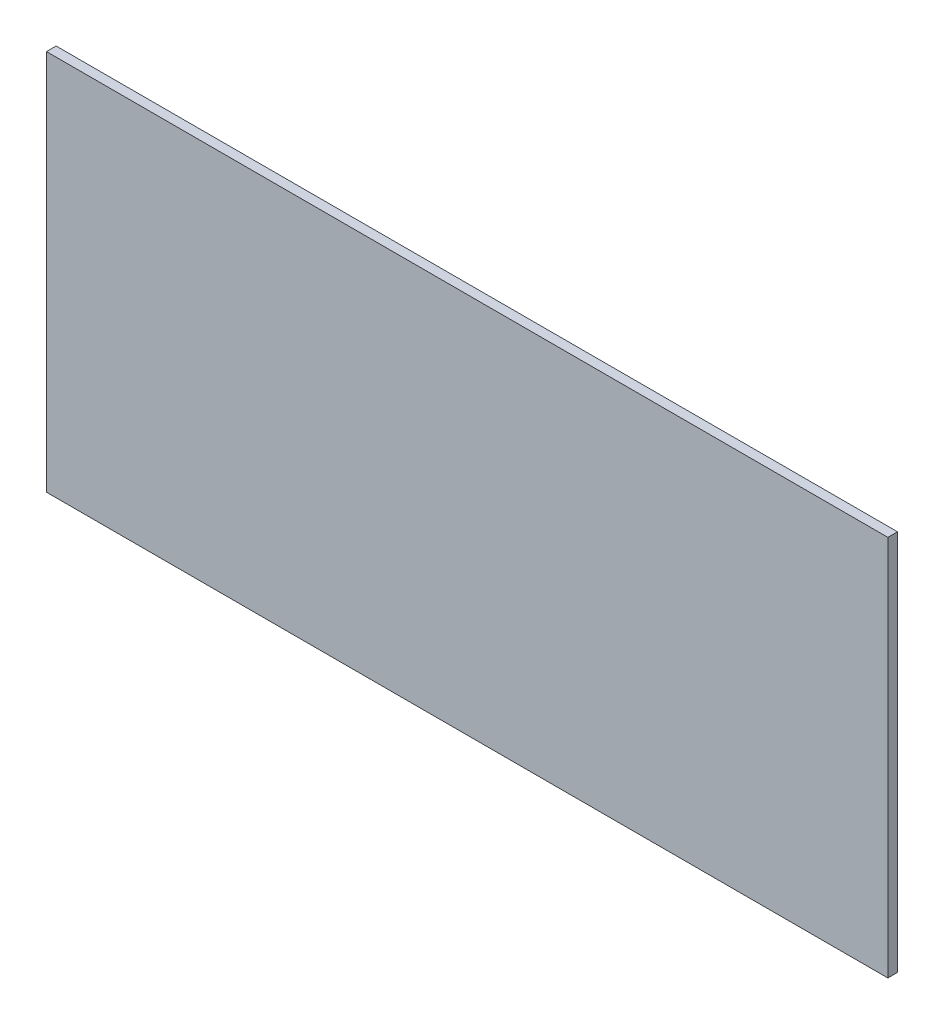
ISO-10303-21;
HEADER;
FILE_DESCRIPTION(('STEP AP214'),'2;1');
FILE_NAME('part.step','',(''),(''),'','','');
FILE_SCHEMA(('AUTOMOTIVE_DESIGN { 1 0 10303 214 1 1 1 1 }'));
ENDSEC;
DATA;
#1=APPLICATION_CONTEXT('core data for automotive mechanical design processes');
#2=APPLICATION_PROTOCOL_DEFINITION('international standard','automotive_design',2000,#1);
#3=PRODUCT_CONTEXT('',#1,'mechanical');
#4=PRODUCT('Part','Part','',(#3));
#5=PRODUCT_RELATED_PRODUCT_CATEGORY('part','',(#4));
#6=PRODUCT_DEFINITION_FORMATION('','',#4);
#7=PRODUCT_DEFINITION_CONTEXT('part definition',#1,'design');
#8=PRODUCT_DEFINITION('design','',#6,#7);
#9=PRODUCT_DEFINITION_SHAPE('','',#8);
#10=(LENGTH_UNIT() NAMED_UNIT(*) SI_UNIT(.MILLI.,.METRE.));
#11=(NAMED_UNIT(*) PLANE_ANGLE_UNIT() SI_UNIT($,.RADIAN.));
#12=(NAMED_UNIT(*) SI_UNIT($,.STERADIAN.) SOLID_ANGLE_UNIT());
#13=UNCERTAINTY_MEASURE_WITH_UNIT(LENGTH_MEASURE(1.E-05),#10,'distance_accuracy_value','');
#14=(GEOMETRIC_REPRESENTATION_CONTEXT(3) GLOBAL_UNCERTAINTY_ASSIGNED_CONTEXT((#13)) GLOBAL_UNIT_ASSIGNED_CONTEXT((#10,
#11,#12)) REPRESENTATION_CONTEXT('',''));
#15=CARTESIAN_POINT('',(0.,0.,0.));
#16=DIRECTION('',(0.,0.,1.));
#17=DIRECTION('',(1.,0.,0.));
#18=AXIS2_PLACEMENT_3D('',#15,#16,#17);
#19=CARTESIAN_POINT('',(-130.64,59.25,3.));
#20=DIRECTION('',(1.,0.,0.));
#21=DIRECTION('',(0.,0.,-1.));
#22=AXIS2_PLACEMENT_3D('',#19,#20,#21);
#23=PLANE('',#22);
#24=DIRECTION('',(0.,-1.,0.));
#25=VECTOR('',#24,1.);
#26=CARTESIAN_POINT('',(-130.64,59.25,0.));
#27=LINE('',#26,#25);
#28=CARTESIAN_POINT('',(-130.64,59.25,0.));
#29=VERTEX_POINT('',#28);
#30=CARTESIAN_POINT('',(-130.64,-59.25,0.));
#31=VERTEX_POINT('',#30);
#32=EDGE_CURVE('E105',#29,#31,#27,.T.);
#33=ORIENTED_EDGE('',*,*,#32,.T.);
#34=DIRECTION('',(0.,0.,-1.));
#35=VECTOR('',#34,1.);
#36=CARTESIAN_POINT('',(-130.64,-59.25,3.));
#37=LINE('',#36,#35);
#38=CARTESIAN_POINT('',(-130.64,-59.25,3.));
#39=VERTEX_POINT('',#38);
#40=EDGE_CURVE('E11',#39,#31,#37,.T.);
#41=ORIENTED_EDGE('',*,*,#40,.F.);
#42=DIRECTION('',(0.,-1.,0.));
#43=VECTOR('',#42,1.);
#44=CARTESIAN_POINT('',(-130.64,59.25,3.));
#45=LINE('',#44,#43);
#46=CARTESIAN_POINT('',(-130.64,59.25,3.));
#47=VERTEX_POINT('',#46);
#48=EDGE_CURVE('E89',#47,#39,#45,.T.);
#49=ORIENTED_EDGE('',*,*,#48,.F.);
#50=DIRECTION('',(0.,0.,-1.));
#51=VECTOR('',#50,1.);
#52=CARTESIAN_POINT('',(-130.64,59.25,3.));
#53=LINE('',#52,#51);
#54=EDGE_CURVE('E98',#47,#29,#53,.T.);
#55=ORIENTED_EDGE('',*,*,#54,.T.);
#56=EDGE_LOOP('',(#33,#41,#49,#55));
#57=FACE_BOUND('',#56,.T.);
#58=ADVANCED_FACE('F39',(#57),#23,.F.);
#59=CARTESIAN_POINT('',(-130.64,-59.25,3.));
#60=DIRECTION('',(0.,1.,0.));
#61=DIRECTION('',(0.,0.,1.));
#62=AXIS2_PLACEMENT_3D('',#59,#60,#61);
#63=PLANE('',#62);
#64=DIRECTION('',(1.,0.,0.));
#65=VECTOR('',#64,1.);
#66=CARTESIAN_POINT('',(-130.64,-59.25,0.));
#67=LINE('',#66,#65);
#68=CARTESIAN_POINT('',(130.64,-59.25,0.));
#69=VERTEX_POINT('',#68);
#70=EDGE_CURVE('E94',#31,#69,#67,.T.);
#71=ORIENTED_EDGE('',*,*,#70,.T.);
#72=DIRECTION('',(0.,0.,-1.));
#73=VECTOR('',#72,1.);
#74=CARTESIAN_POINT('',(130.64,-59.25,3.));
#75=LINE('',#74,#73);
#76=CARTESIAN_POINT('',(130.64,-59.25,3.));
#77=VERTEX_POINT('',#76);
#78=EDGE_CURVE('E50',#77,#69,#75,.T.);
#79=ORIENTED_EDGE('',*,*,#78,.F.);
#80=DIRECTION('',(1.,0.,0.));
#81=VECTOR('',#80,1.);
#82=CARTESIAN_POINT('',(-130.64,-59.25,3.));
#83=LINE('',#82,#81);
#84=EDGE_CURVE('E84',#39,#77,#83,.T.);
#85=ORIENTED_EDGE('',*,*,#84,.F.);
#86=ORIENTED_EDGE('',*,*,#40,.T.);
#87=EDGE_LOOP('',(#71,#79,#85,#86));
#88=FACE_BOUND('',#87,.T.);
#89=ADVANCED_FACE('F91',(#88),#63,.F.);
#90=CARTESIAN_POINT('',(130.64,-59.25,3.));
#91=DIRECTION('',(-1.,0.,0.));
#92=DIRECTION('',(0.,0.,1.));
#93=AXIS2_PLACEMENT_3D('',#90,#91,#92);
#94=PLANE('',#93);
#95=DIRECTION('',(0.,1.,0.));
#96=VECTOR('',#95,1.);
#97=CARTESIAN_POINT('',(130.64,-59.25,0.));
#98=LINE('',#97,#96);
#99=CARTESIAN_POINT('',(130.64,59.25,0.));
#100=VERTEX_POINT('',#99);
#101=EDGE_CURVE('E75',#69,#100,#98,.T.);
#102=ORIENTED_EDGE('',*,*,#101,.T.);
#103=DIRECTION('',(0.,0.,-1.));
#104=VECTOR('',#103,1.);
#105=CARTESIAN_POINT('',(130.64,59.25,3.));
#106=LINE('',#105,#104);
#107=CARTESIAN_POINT('',(130.64,59.25,3.));
#108=VERTEX_POINT('',#107);
#109=EDGE_CURVE('E92',#108,#100,#106,.T.);
#110=ORIENTED_EDGE('',*,*,#109,.F.);
#111=DIRECTION('',(0.,1.,0.));
#112=VECTOR('',#111,1.);
#113=CARTESIAN_POINT('',(130.64,-59.25,3.));
#114=LINE('',#113,#112);
#115=EDGE_CURVE('E86',#77,#108,#114,.T.);
#116=ORIENTED_EDGE('',*,*,#115,.F.);
#117=ORIENTED_EDGE('',*,*,#78,.T.);
#118=EDGE_LOOP('',(#102,#110,#116,#117));
#119=FACE_BOUND('',#118,.T.);
#120=ADVANCED_FACE('F96',(#119),#94,.F.);
#121=CARTESIAN_POINT('',(-130.64,59.25,3.));
#122=DIRECTION('',(0.,-1.,0.));
#123=DIRECTION('',(0.,0.,-1.));
#124=AXIS2_PLACEMENT_3D('',#121,#122,#123);
#125=PLANE('',#124);
#126=DIRECTION('',(-1.,0.,0.));
#127=VECTOR('',#126,1.);
#128=CARTESIAN_POINT('',(-130.64,59.25,0.));
#129=LINE('',#128,#127);
#130=EDGE_CURVE('E79',#100,#29,#129,.T.);
#131=ORIENTED_EDGE('',*,*,#130,.T.);
#132=ORIENTED_EDGE('',*,*,#54,.F.);
#133=DIRECTION('',(-1.,0.,0.));
#134=VECTOR('',#133,1.);
#135=CARTESIAN_POINT('',(-130.64,59.25,3.));
#136=LINE('',#135,#134);
#137=EDGE_CURVE('E54',#108,#47,#136,.T.);
#138=ORIENTED_EDGE('',*,*,#137,.F.);
#139=ORIENTED_EDGE('',*,*,#109,.T.);
#140=EDGE_LOOP('',(#131,#132,#138,#139));
#141=FACE_BOUND('',#140,.T.);
#142=ADVANCED_FACE('F108',(#141),#125,.F.);
#143=CARTESIAN_POINT('',(0.,0.,3.));
#144=DIRECTION('',(0.,0.,1.));
#145=DIRECTION('',(1.,0.,0.));
#146=AXIS2_PLACEMENT_3D('',#143,#144,#145);
#147=PLANE('',#146);
#148=ORIENTED_EDGE('',*,*,#48,.T.);
#149=ORIENTED_EDGE('',*,*,#84,.T.);
#150=ORIENTED_EDGE('',*,*,#115,.T.);
#151=ORIENTED_EDGE('',*,*,#137,.T.);
#152=EDGE_LOOP('',(#148,#149,#150,#151));
#153=FACE_BOUND('',#152,.T.);
#154=ADVANCED_FACE('F88',(#153),#147,.T.);
#155=CARTESIAN_POINT('',(0.,0.,0.));
#156=DIRECTION('',(0.,0.,1.));
#157=DIRECTION('',(1.,0.,0.));
#158=AXIS2_PLACEMENT_3D('',#155,#156,#157);
#159=PLANE('',#158);
#160=ORIENTED_EDGE('',*,*,#32,.F.);
#161=ORIENTED_EDGE('',*,*,#130,.F.);
#162=ORIENTED_EDGE('',*,*,#101,.F.);
#163=ORIENTED_EDGE('',*,*,#70,.F.);
#164=EDGE_LOOP('',(#160,#161,#162,#163));
#165=FACE_BOUND('',#164,.T.);
#166=ADVANCED_FACE('F115',(#165),#159,.F.);
#167=CLOSED_SHELL('',(#58,#89,#120,#142,#154,#166));
#168=MANIFOLD_SOLID_BREP('B2',#167);
#169=ADVANCED_BREP_SHAPE_REPRESENTATION('',(#18,#168),#14);
#170=SHAPE_DEFINITION_REPRESENTATION(#9,#169);
ENDSEC;
END-ISO-10303-21;
